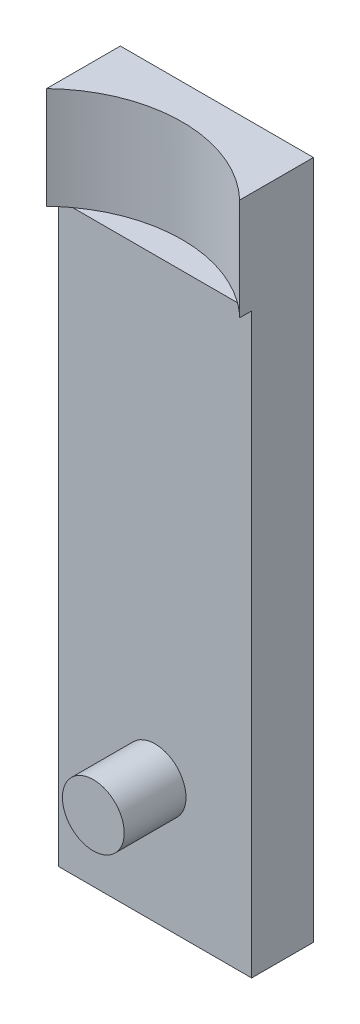
ISO-10303-21;
HEADER;
FILE_DESCRIPTION(('STEP AP214'),'2;1');
FILE_NAME('part.step','',(''),(''),'','','');
FILE_SCHEMA(('AUTOMOTIVE_DESIGN { 1 0 10303 214 1 1 1 1 }'));
ENDSEC;
DATA;
#1=APPLICATION_CONTEXT('core data for automotive mechanical design processes');
#2=APPLICATION_PROTOCOL_DEFINITION('international standard','automotive_design',2000,#1);
#3=PRODUCT_CONTEXT('',#1,'mechanical');
#4=PRODUCT('Part','Part','',(#3));
#5=PRODUCT_RELATED_PRODUCT_CATEGORY('part','',(#4));
#6=PRODUCT_DEFINITION_FORMATION('','',#4);
#7=PRODUCT_DEFINITION_CONTEXT('part definition',#1,'design');
#8=PRODUCT_DEFINITION('design','',#6,#7);
#9=PRODUCT_DEFINITION_SHAPE('','',#8);
#10=(LENGTH_UNIT() NAMED_UNIT(*) SI_UNIT(.MILLI.,.METRE.));
#11=(NAMED_UNIT(*) PLANE_ANGLE_UNIT() SI_UNIT($,.RADIAN.));
#12=(NAMED_UNIT(*) SI_UNIT($,.STERADIAN.) SOLID_ANGLE_UNIT());
#13=UNCERTAINTY_MEASURE_WITH_UNIT(LENGTH_MEASURE(1.E-05),#10,'distance_accuracy_value','');
#14=(GEOMETRIC_REPRESENTATION_CONTEXT(3) GLOBAL_UNCERTAINTY_ASSIGNED_CONTEXT((#13)) GLOBAL_UNIT_ASSIGNED_CONTEXT((#10,
#11,#12)) REPRESENTATION_CONTEXT('',''));
#15=CARTESIAN_POINT('',(0.,0.,0.));
#16=DIRECTION('',(0.,0.,1.));
#17=DIRECTION('',(1.,0.,0.));
#18=AXIS2_PLACEMENT_3D('',#15,#16,#17);
#19=CARTESIAN_POINT('',(0.,-70.,40.));
#20=DIRECTION('',(0.,0.,-1.));
#21=DIRECTION('',(-1.,0.,0.));
#22=AXIS2_PLACEMENT_3D('',#19,#20,#21);
#23=CYLINDRICAL_SURFACE('',#22,10.);
#24=CARTESIAN_POINT('',(0.,-70.,40.));
#25=DIRECTION('',(0.,0.,1.));
#26=DIRECTION('',(1.,0.,0.));
#27=AXIS2_PLACEMENT_3D('',#24,#25,#26);
#28=CIRCLE('',#27,10.);
#29=CARTESIAN_POINT('',(10.,-70.,40.));
#30=VERTEX_POINT('',#29);
#31=EDGE_CURVE('E11',#30,#30,#28,.T.);
#32=ORIENTED_EDGE('',*,*,#31,.F.);
#33=EDGE_LOOP('',(#32));
#34=FACE_BOUND('',#33,.T.);
#35=CARTESIAN_POINT('',(0.,-70.,20.));
#36=DIRECTION('',(0.,0.,1.));
#37=DIRECTION('',(1.,0.,0.));
#38=AXIS2_PLACEMENT_3D('',#35,#36,#37);
#39=CIRCLE('',#38,10.);
#40=CARTESIAN_POINT('',(10.,-70.,20.));
#41=VERTEX_POINT('',#40);
#42=EDGE_CURVE('E51',#41,#41,#39,.T.);
#43=ORIENTED_EDGE('',*,*,#42,.T.);
#44=EDGE_LOOP('',(#43));
#45=FACE_BOUND('',#44,.T.);
#46=ADVANCED_FACE('F48',(#34,#45),#23,.T.);
#47=CARTESIAN_POINT('',(0.,-70.,40.));
#48=DIRECTION('',(0.,0.,1.));
#49=DIRECTION('',(1.,0.,0.));
#50=AXIS2_PLACEMENT_3D('',#47,#48,#49);
#51=PLANE('',#50);
#52=ORIENTED_EDGE('',*,*,#31,.T.);
#53=EDGE_LOOP('',(#52));
#54=FACE_BOUND('',#53,.T.);
#55=ADVANCED_FACE('F65',(#54),#51,.T.);
#56=CARTESIAN_POINT('',(0.,-70.,20.));
#57=DIRECTION('',(0.,0.,1.));
#58=DIRECTION('',(1.,0.,0.));
#59=AXIS2_PLACEMENT_3D('',#56,#57,#58);
#60=PLANE('',#59);
#61=ORIENTED_EDGE('',*,*,#42,.F.);
#62=EDGE_LOOP('',(#61));
#63=FACE_BOUND('',#62,.T.);
#64=ADVANCED_FACE('F63',(#63),#60,.F.);
#65=CLOSED_SHELL('',(#46,#55,#64));
#66=MANIFOLD_SOLID_BREP('B2',#65);
#67=CARTESIAN_POINT('',(-31.25,77.,25.));
#68=DIRECTION('',(0.,1.,0.));
#69=DIRECTION('',(0.,0.,1.));
#70=AXIS2_PLACEMENT_3D('',#67,#68,#69);
#71=PLANE('',#70);
#72=DIRECTION('',(0.,0.,-1.));
#73=VECTOR('',#72,1.);
#74=CARTESIAN_POINT('',(31.25,77.,25.));
#75=LINE('',#74,#73);
#76=CARTESIAN_POINT('',(31.25,77.,23.8704153825281));
#77=VERTEX_POINT('',#76);
#78=CARTESIAN_POINT('',(31.25,77.,20.));
#79=VERTEX_POINT('',#78);
#80=EDGE_CURVE('E248',#77,#79,#75,.T.);
#81=ORIENTED_EDGE('',*,*,#80,.F.);
#82=CARTESIAN_POINT('',(2.39391839684799E-13,77.,56.2499999999999));
#83=DIRECTION('',(0.,1.,0.));
#84=DIRECTION('',(0.,0.,1.));
#85=AXIS2_PLACEMENT_3D('',#82,#83,#84);
#86=CIRCLE('',#85,45.);
#87=CARTESIAN_POINT('',(26.6634112596273,77.,20.));
#88=VERTEX_POINT('',#87);
#89=EDGE_CURVE('E218',#77,#88,#86,.T.);
#90=ORIENTED_EDGE('',*,*,#89,.T.);
#91=DIRECTION('',(1.,0.,0.));
#92=VECTOR('',#91,1.);
#93=CARTESIAN_POINT('',(-31.25,77.,20.));
#94=LINE('',#93,#92);
#95=EDGE_CURVE('E240',#88,#79,#94,.T.);
#96=ORIENTED_EDGE('',*,*,#95,.T.);
#97=EDGE_LOOP('',(#81,#90,#96));
#98=FACE_BOUND('',#97,.T.);
#99=ADVANCED_FACE('F93',(#98),#71,.F.);
#100=CARTESIAN_POINT('',(31.25,110.,20.));
#101=DIRECTION('',(-1.,0.,0.));
#102=DIRECTION('',(0.,-1.,0.));
#103=AXIS2_PLACEMENT_3D('',#100,#101,#102);
#104=PLANE('',#103);
#105=DIRECTION('',(0.,0.,-1.));
#106=VECTOR('',#105,1.);
#107=CARTESIAN_POINT('',(31.25,110.,20.));
#108=LINE('',#107,#106);
#109=CARTESIAN_POINT('',(31.25,110.,23.8704153825281));
#110=VERTEX_POINT('',#109);
#111=CARTESIAN_POINT('',(31.25,110.,0.));
#112=VERTEX_POINT('',#111);
#113=EDGE_CURVE('E288',#110,#112,#108,.T.);
#114=ORIENTED_EDGE('',*,*,#113,.F.);
#115=DIRECTION('',(0.,1.,0.));
#116=VECTOR('',#115,1.);
#117=CARTESIAN_POINT('',(31.25,77.,23.8704153825281));
#118=LINE('',#117,#116);
#119=EDGE_CURVE('E222',#77,#110,#118,.T.);
#120=ORIENTED_EDGE('',*,*,#119,.F.);
#121=ORIENTED_EDGE('',*,*,#80,.T.);
#122=DIRECTION('',(0.,1.,0.));
#123=VECTOR('',#122,1.);
#124=CARTESIAN_POINT('',(31.25,110.,20.));
#125=LINE('',#124,#123);
#126=CARTESIAN_POINT('',(31.25,-110.,20.));
#127=VERTEX_POINT('',#126);
#128=EDGE_CURVE('E254',#127,#79,#125,.T.);
#129=ORIENTED_EDGE('',*,*,#128,.F.);
#130=DIRECTION('',(0.,0.,-1.));
#131=VECTOR('',#130,1.);
#132=CARTESIAN_POINT('',(31.25,-110.,20.));
#133=LINE('',#132,#131);
#134=CARTESIAN_POINT('',(31.25,-110.,0.));
#135=VERTEX_POINT('',#134);
#136=EDGE_CURVE('E265',#127,#135,#133,.T.);
#137=ORIENTED_EDGE('',*,*,#136,.T.);
#138=DIRECTION('',(0.,1.,0.));
#139=VECTOR('',#138,1.);
#140=CARTESIAN_POINT('',(31.25,110.,0.));
#141=LINE('',#140,#139);
#142=EDGE_CURVE('E253',#135,#112,#141,.T.);
#143=ORIENTED_EDGE('',*,*,#142,.T.);
#144=EDGE_LOOP('',(#114,#120,#121,#129,#137,#143));
#145=FACE_BOUND('',#144,.T.);
#146=ADVANCED_FACE('F95',(#145),#104,.F.);
#147=CARTESIAN_POINT('',(-31.25,110.,20.));
#148=DIRECTION('',(0.,-1.,0.));
#149=DIRECTION('',(0.,0.,-1.));
#150=AXIS2_PLACEMENT_3D('',#147,#148,#149);
#151=PLANE('',#150);
#152=DIRECTION('',(0.,0.,-1.));
#153=VECTOR('',#152,1.);
#154=CARTESIAN_POINT('',(-31.25,110.,20.));
#155=LINE('',#154,#153);
#156=CARTESIAN_POINT('',(-31.25,110.,23.8704153825286));
#157=VERTEX_POINT('',#156);
#158=CARTESIAN_POINT('',(-31.25,110.,0.));
#159=VERTEX_POINT('',#158);
#160=EDGE_CURVE('E285',#157,#159,#155,.T.);
#161=ORIENTED_EDGE('',*,*,#160,.F.);
#162=CARTESIAN_POINT('',(2.39391839684799E-13,110.,56.2499999999999));
#163=DIRECTION('',(0.,1.,0.));
#164=DIRECTION('',(0.,0.,1.));
#165=AXIS2_PLACEMENT_3D('',#162,#163,#164);
#166=CIRCLE('',#165,45.);
#167=EDGE_CURVE('E216',#110,#157,#166,.T.);
#168=ORIENTED_EDGE('',*,*,#167,.F.);
#169=ORIENTED_EDGE('',*,*,#113,.T.);
#170=DIRECTION('',(-1.,0.,0.));
#171=VECTOR('',#170,1.);
#172=CARTESIAN_POINT('',(-31.25,110.,0.));
#173=LINE('',#172,#171);
#174=EDGE_CURVE('E269',#112,#159,#173,.T.);
#175=ORIENTED_EDGE('',*,*,#174,.T.);
#176=EDGE_LOOP('',(#161,#168,#169,#175));
#177=FACE_BOUND('',#176,.T.);
#178=ADVANCED_FACE('F311',(#177),#151,.F.);
#179=CARTESIAN_POINT('',(-31.25,110.,20.));
#180=DIRECTION('',(1.,0.,0.));
#181=DIRECTION('',(0.,1.,0.));
#182=AXIS2_PLACEMENT_3D('',#179,#180,#181);
#183=PLANE('',#182);
#184=DIRECTION('',(0.,0.,-1.));
#185=VECTOR('',#184,1.);
#186=CARTESIAN_POINT('',(-31.25,77.,25.));
#187=LINE('',#186,#185);
#188=CARTESIAN_POINT('',(-31.25,77.,23.8704153825286));
#189=VERTEX_POINT('',#188);
#190=CARTESIAN_POINT('',(-31.25,77.,20.));
#191=VERTEX_POINT('',#190);
#192=EDGE_CURVE('E251',#189,#191,#187,.T.);
#193=ORIENTED_EDGE('',*,*,#192,.F.);
#194=DIRECTION('',(0.,1.,0.));
#195=VECTOR('',#194,1.);
#196=CARTESIAN_POINT('',(-31.25,77.,23.8704153825286));
#197=LINE('',#196,#195);
#198=EDGE_CURVE('E117',#189,#157,#197,.T.);
#199=ORIENTED_EDGE('',*,*,#198,.T.);
#200=ORIENTED_EDGE('',*,*,#160,.T.);
#201=DIRECTION('',(0.,-1.,0.));
#202=VECTOR('',#201,1.);
#203=CARTESIAN_POINT('',(-31.25,110.,0.));
#204=LINE('',#203,#202);
#205=CARTESIAN_POINT('',(-31.25,-110.,0.));
#206=VERTEX_POINT('',#205);
#207=EDGE_CURVE('E273',#159,#206,#204,.T.);
#208=ORIENTED_EDGE('',*,*,#207,.T.);
#209=DIRECTION('',(0.,0.,-1.));
#210=VECTOR('',#209,1.);
#211=CARTESIAN_POINT('',(-31.25,-110.,20.));
#212=LINE('',#211,#210);
#213=CARTESIAN_POINT('',(-31.25,-110.,20.));
#214=VERTEX_POINT('',#213);
#215=EDGE_CURVE('E281',#214,#206,#212,.T.);
#216=ORIENTED_EDGE('',*,*,#215,.F.);
#217=DIRECTION('',(0.,-1.,0.));
#218=VECTOR('',#217,1.);
#219=CARTESIAN_POINT('',(-31.25,110.,20.));
#220=LINE('',#219,#218);
#221=EDGE_CURVE('E258',#191,#214,#220,.T.);
#222=ORIENTED_EDGE('',*,*,#221,.F.);
#223=EDGE_LOOP('',(#193,#199,#200,#208,#216,#222));
#224=FACE_BOUND('',#223,.T.);
#225=ADVANCED_FACE('F316',(#224),#183,.F.);
#226=CARTESIAN_POINT('',(-31.25,-110.,20.));
#227=DIRECTION('',(0.,1.,0.));
#228=DIRECTION('',(0.,0.,1.));
#229=AXIS2_PLACEMENT_3D('',#226,#227,#228);
#230=PLANE('',#229);
#231=DIRECTION('',(1.,0.,0.));
#232=VECTOR('',#231,1.);
#233=CARTESIAN_POINT('',(-31.25,-110.,0.));
#234=LINE('',#233,#232);
#235=EDGE_CURVE('E259',#206,#135,#234,.T.);
#236=ORIENTED_EDGE('',*,*,#235,.T.);
#237=ORIENTED_EDGE('',*,*,#136,.F.);
#238=DIRECTION('',(1.,0.,0.));
#239=VECTOR('',#238,1.);
#240=CARTESIAN_POINT('',(-31.25,-110.,20.));
#241=LINE('',#240,#239);
#242=EDGE_CURVE('E262',#214,#127,#241,.T.);
#243=ORIENTED_EDGE('',*,*,#242,.F.);
#244=ORIENTED_EDGE('',*,*,#215,.T.);
#245=EDGE_LOOP('',(#236,#237,#243,#244));
#246=FACE_BOUND('',#245,.T.);
#247=ADVANCED_FACE('F354',(#246),#230,.F.);
#248=CARTESIAN_POINT('',(0.,0.,20.));
#249=DIRECTION('',(0.,0.,1.));
#250=DIRECTION('',(1.,0.,0.));
#251=AXIS2_PLACEMENT_3D('',#248,#249,#250);
#252=PLANE('',#251);
#253=CARTESIAN_POINT('',(0.,-70.,20.));
#254=DIRECTION('',(0.,0.,1.));
#255=DIRECTION('',(1.,0.,0.));
#256=AXIS2_PLACEMENT_3D('',#253,#254,#255);
#257=CIRCLE('',#256,10.);
#258=CARTESIAN_POINT('',(10.,-70.,20.));
#259=VERTEX_POINT('',#258);
#260=EDGE_CURVE('E235',#259,#259,#257,.T.);
#261=ORIENTED_EDGE('',*,*,#260,.F.);
#262=EDGE_LOOP('',(#261));
#263=FACE_BOUND('',#262,.T.);
#264=CARTESIAN_POINT('',(-26.6634112596268,77.,20.));
#265=VERTEX_POINT('',#264);
#266=EDGE_CURVE('E244',#191,#265,#94,.T.);
#267=ORIENTED_EDGE('',*,*,#266,.F.);
#268=ORIENTED_EDGE('',*,*,#221,.T.);
#269=ORIENTED_EDGE('',*,*,#242,.T.);
#270=ORIENTED_EDGE('',*,*,#128,.T.);
#271=ORIENTED_EDGE('',*,*,#95,.F.);
#272=DIRECTION('',(-1.,0.,0.));
#273=VECTOR('',#272,1.);
#274=CARTESIAN_POINT('',(0.,77.,20.));
#275=LINE('',#274,#273);
#276=EDGE_CURVE('E229',#88,#265,#275,.T.);
#277=ORIENTED_EDGE('',*,*,#276,.T.);
#278=EDGE_LOOP('',(#267,#268,#269,#270,#271,#277));
#279=FACE_BOUND('',#278,.T.);
#280=ADVANCED_FACE('F299',(#263,#279),#252,.T.);
#281=CARTESIAN_POINT('',(0.,0.,0.));
#282=DIRECTION('',(0.,0.,1.));
#283=DIRECTION('',(1.,0.,0.));
#284=AXIS2_PLACEMENT_3D('',#281,#282,#283);
#285=PLANE('',#284);
#286=CARTESIAN_POINT('',(0.,-70.,0.));
#287=DIRECTION('',(0.,0.,1.));
#288=DIRECTION('',(1.,0.,0.));
#289=AXIS2_PLACEMENT_3D('',#286,#287,#288);
#290=CIRCLE('',#289,10.);
#291=CARTESIAN_POINT('',(9.9785412739734,-69.3452374143178,0.));
#292=VERTEX_POINT('',#291);
#293=CARTESIAN_POINT('',(9.5794165859271,-72.8696302676939,0.));
#294=VERTEX_POINT('',#293);
#295=EDGE_CURVE('E236',#292,#294,#290,.T.);
#296=ORIENTED_EDGE('',*,*,#295,.T.);
#297=DIRECTION('',(-1.,0.,0.));
#298=VECTOR('',#297,1.);
#299=CARTESIAN_POINT('',(9.5794165859271,-72.8696302676939,0.));
#300=LINE('',#299,#298);
#301=CARTESIAN_POINT('',(13.3410048480869,-72.8696302676939,0.));
#302=VERTEX_POINT('',#301);
#303=EDGE_CURVE('E184',#302,#294,#300,.T.);
#304=ORIENTED_EDGE('',*,*,#303,.F.);
#305=DIRECTION('',(0.,-1.,0.));
#306=VECTOR('',#305,1.);
#307=CARTESIAN_POINT('',(13.3410048480869,-72.8696302676939,0.));
#308=LINE('',#307,#306);
#309=CARTESIAN_POINT('',(13.3410048480869,-69.3452374143178,0.));
#310=VERTEX_POINT('',#309);
#311=EDGE_CURVE('E207',#310,#302,#308,.T.);
#312=ORIENTED_EDGE('',*,*,#311,.F.);
#313=DIRECTION('',(1.,0.,0.));
#314=VECTOR('',#313,1.);
#315=CARTESIAN_POINT('',(9.5794165859271,-69.3452374143178,0.));
#316=LINE('',#315,#314);
#317=EDGE_CURVE('E190',#292,#310,#316,.T.);
#318=ORIENTED_EDGE('',*,*,#317,.F.);
#319=EDGE_LOOP('',(#296,#304,#312,#318));
#320=FACE_BOUND('',#319,.T.);
#321=ORIENTED_EDGE('',*,*,#142,.F.);
#322=ORIENTED_EDGE('',*,*,#235,.F.);
#323=ORIENTED_EDGE('',*,*,#207,.F.);
#324=ORIENTED_EDGE('',*,*,#174,.F.);
#325=EDGE_LOOP('',(#321,#322,#323,#324));
#326=FACE_BOUND('',#325,.T.);
#327=ADVANCED_FACE('F343',(#320,#326),#285,.F.);
#328=ORIENTED_EDGE('',*,*,#266,.T.);
#329=EDGE_CURVE('E224',#265,#189,#86,.T.);
#330=ORIENTED_EDGE('',*,*,#329,.T.);
#331=ORIENTED_EDGE('',*,*,#192,.T.);
#332=EDGE_LOOP('',(#328,#330,#331));
#333=FACE_BOUND('',#332,.T.);
#334=ADVANCED_FACE('F320',(#333),#71,.F.);
#335=CARTESIAN_POINT('',(0.,-70.,0.));
#336=DIRECTION('',(0.,0.,1.));
#337=DIRECTION('',(1.,0.,0.));
#338=AXIS2_PLACEMENT_3D('',#335,#336,#337);
#339=CYLINDRICAL_SURFACE('',#338,10.);
#340=CARTESIAN_POINT('',(0.,-70.,7.));
#341=DIRECTION('',(0.,0.,-1.));
#342=DIRECTION('',(-1.,0.,0.));
#343=AXIS2_PLACEMENT_3D('',#340,#341,#342);
#344=CIRCLE('',#343,10.);
#345=CARTESIAN_POINT('',(9.5794165859271,-72.8696302676939,7.));
#346=VERTEX_POINT('',#345);
#347=CARTESIAN_POINT('',(9.9785412739734,-69.3452374143178,7.));
#348=VERTEX_POINT('',#347);
#349=EDGE_CURVE('E102',#346,#348,#344,.F.);
#350=ORIENTED_EDGE('',*,*,#349,.F.);
#351=DIRECTION('',(0.,0.,-1.));
#352=VECTOR('',#351,1.);
#353=CARTESIAN_POINT('',(9.5794165859271,-72.8696302676939,7.));
#354=LINE('',#353,#352);
#355=EDGE_CURVE('E212',#346,#294,#354,.T.);
#356=ORIENTED_EDGE('',*,*,#355,.T.);
#357=ORIENTED_EDGE('',*,*,#295,.F.);
#358=DIRECTION('',(0.,0.,1.));
#359=VECTOR('',#358,1.);
#360=CARTESIAN_POINT('',(9.9785412739734,-69.3452374143178,0.));
#361=LINE('',#360,#359);
#362=EDGE_CURVE('E46',#292,#348,#361,.T.);
#363=ORIENTED_EDGE('',*,*,#362,.T.);
#364=EDGE_LOOP('',(#350,#356,#357,#363));
#365=FACE_BOUND('',#364,.T.);
#366=ORIENTED_EDGE('',*,*,#260,.T.);
#367=EDGE_LOOP('',(#366));
#368=FACE_BOUND('',#367,.T.);
#369=ADVANCED_FACE('F333',(#365,#368),#339,.F.);
#370=CARTESIAN_POINT('',(2.39391839684799E-13,77.,56.2499999999999));
#371=DIRECTION('',(0.,1.,0.));
#372=DIRECTION('',(0.,0.,1.));
#373=AXIS2_PLACEMENT_3D('',#370,#371,#372);
#374=CYLINDRICAL_SURFACE('',#373,45.);
#375=ORIENTED_EDGE('',*,*,#167,.T.);
#376=ORIENTED_EDGE('',*,*,#198,.F.);
#377=ORIENTED_EDGE('',*,*,#329,.F.);
#378=EDGE_CURVE('E223',#88,#265,#86,.T.);
#379=ORIENTED_EDGE('',*,*,#378,.F.);
#380=ORIENTED_EDGE('',*,*,#89,.F.);
#381=ORIENTED_EDGE('',*,*,#119,.T.);
#382=EDGE_LOOP('',(#375,#376,#377,#379,#380,#381));
#383=FACE_BOUND('',#382,.T.);
#384=ADVANCED_FACE('F307',(#383),#374,.F.);
#385=CARTESIAN_POINT('',(0.,77.,0.));
#386=DIRECTION('',(0.,1.,0.));
#387=DIRECTION('',(0.,0.,1.));
#388=AXIS2_PLACEMENT_3D('',#385,#386,#387);
#389=PLANE('',#388);
#390=ORIENTED_EDGE('',*,*,#378,.T.);
#391=ORIENTED_EDGE('',*,*,#276,.F.);
#392=EDGE_LOOP('',(#390,#391));
#393=FACE_BOUND('',#392,.T.);
#394=ADVANCED_FACE('F323',(#393),#389,.T.);
#395=CARTESIAN_POINT('',(9.5794165859271,-69.3452374143178,7.));
#396=DIRECTION('',(0.,1.,0.));
#397=DIRECTION('',(0.,0.,1.));
#398=AXIS2_PLACEMENT_3D('',#395,#396,#397);
#399=PLANE('',#398);
#400=ORIENTED_EDGE('',*,*,#317,.T.);
#401=DIRECTION('',(0.,0.,-1.));
#402=VECTOR('',#401,1.);
#403=CARTESIAN_POINT('',(13.3410048480869,-69.3452374143178,7.));
#404=LINE('',#403,#402);
#405=CARTESIAN_POINT('',(13.3410048480869,-69.3452374143178,7.));
#406=VERTEX_POINT('',#405);
#407=EDGE_CURVE('E187',#406,#310,#404,.T.);
#408=ORIENTED_EDGE('',*,*,#407,.F.);
#409=DIRECTION('',(1.,0.,0.));
#410=VECTOR('',#409,1.);
#411=CARTESIAN_POINT('',(9.5794165859271,-69.3452374143178,7.));
#412=LINE('',#411,#410);
#413=EDGE_CURVE('E176',#348,#406,#412,.T.);
#414=ORIENTED_EDGE('',*,*,#413,.F.);
#415=ORIENTED_EDGE('',*,*,#362,.F.);
#416=EDGE_LOOP('',(#400,#408,#414,#415));
#417=FACE_BOUND('',#416,.T.);
#418=ADVANCED_FACE('F188',(#417),#399,.F.);
#419=CARTESIAN_POINT('',(0.,0.,7.));
#420=DIRECTION('',(0.,0.,-1.));
#421=DIRECTION('',(-1.,0.,0.));
#422=AXIS2_PLACEMENT_3D('',#419,#420,#421);
#423=PLANE('',#422);
#424=ORIENTED_EDGE('',*,*,#349,.T.);
#425=ORIENTED_EDGE('',*,*,#413,.T.);
#426=DIRECTION('',(0.,-1.,0.));
#427=VECTOR('',#426,1.);
#428=CARTESIAN_POINT('',(13.3410048480869,-72.8696302676939,7.));
#429=LINE('',#428,#427);
#430=CARTESIAN_POINT('',(13.3410048480869,-72.8696302676939,7.));
#431=VERTEX_POINT('',#430);
#432=EDGE_CURVE('E180',#406,#431,#429,.T.);
#433=ORIENTED_EDGE('',*,*,#432,.T.);
#434=DIRECTION('',(-1.,0.,0.));
#435=VECTOR('',#434,1.);
#436=CARTESIAN_POINT('',(9.5794165859271,-72.8696302676939,7.));
#437=LINE('',#436,#435);
#438=EDGE_CURVE('E109',#431,#346,#437,.T.);
#439=ORIENTED_EDGE('',*,*,#438,.T.);
#440=EDGE_LOOP('',(#424,#425,#433,#439));
#441=FACE_BOUND('',#440,.T.);
#442=ADVANCED_FACE('F178',(#441),#423,.T.);
#443=CARTESIAN_POINT('',(9.5794165859271,-72.8696302676939,7.));
#444=DIRECTION('',(0.,-1.,0.));
#445=DIRECTION('',(0.,0.,-1.));
#446=AXIS2_PLACEMENT_3D('',#443,#444,#445);
#447=PLANE('',#446);
#448=ORIENTED_EDGE('',*,*,#303,.T.);
#449=ORIENTED_EDGE('',*,*,#355,.F.);
#450=ORIENTED_EDGE('',*,*,#438,.F.);
#451=DIRECTION('',(0.,0.,-1.));
#452=VECTOR('',#451,1.);
#453=CARTESIAN_POINT('',(13.3410048480869,-72.8696302676939,7.));
#454=LINE('',#453,#452);
#455=EDGE_CURVE('E195',#431,#302,#454,.T.);
#456=ORIENTED_EDGE('',*,*,#455,.T.);
#457=EDGE_LOOP('',(#448,#449,#450,#456));
#458=FACE_BOUND('',#457,.T.);
#459=ADVANCED_FACE('F407',(#458),#447,.F.);
#460=CARTESIAN_POINT('',(13.3410048480869,-72.8696302676939,7.));
#461=DIRECTION('',(1.,0.,0.));
#462=DIRECTION('',(0.,0.,-1.));
#463=AXIS2_PLACEMENT_3D('',#460,#461,#462);
#464=PLANE('',#463);
#465=ORIENTED_EDGE('',*,*,#311,.T.);
#466=ORIENTED_EDGE('',*,*,#455,.F.);
#467=ORIENTED_EDGE('',*,*,#432,.F.);
#468=ORIENTED_EDGE('',*,*,#407,.T.);
#469=EDGE_LOOP('',(#465,#466,#467,#468));
#470=FACE_BOUND('',#469,.T.);
#471=ADVANCED_FACE('F197',(#470),#464,.F.);
#472=CLOSED_SHELL('',(#99,#146,#178,#225,#247,#280,#327,#334,#369,#384,#394,#418,#442,#459,#471));
#473=MANIFOLD_SOLID_BREP('B6',#472);
#474=ADVANCED_BREP_SHAPE_REPRESENTATION('',(#18,#66,#473),#14);
#475=SHAPE_DEFINITION_REPRESENTATION(#9,#474);
ENDSEC;
END-ISO-10303-21;
